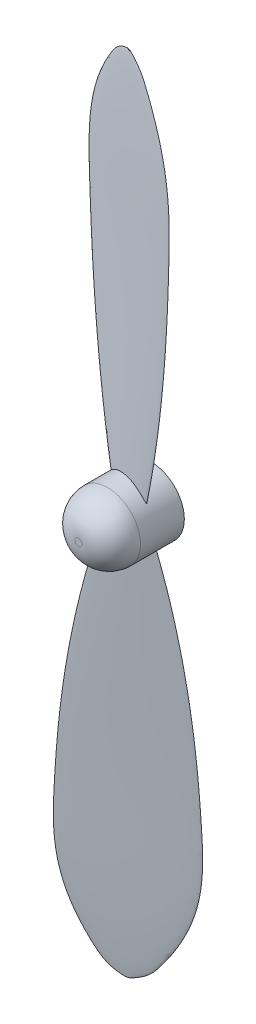
ISO-10303-21;
HEADER;
FILE_DESCRIPTION(('STEP AP214'),'2;1');
FILE_NAME('part.step','',(''),(''),'','','');
FILE_SCHEMA(('AUTOMOTIVE_DESIGN { 1 0 10303 214 1 1 1 1 }'));
ENDSEC;
DATA;
#1=APPLICATION_CONTEXT('core data for automotive mechanical design processes');
#2=APPLICATION_PROTOCOL_DEFINITION('international standard','automotive_design',2000,#1);
#3=PRODUCT_CONTEXT('',#1,'mechanical');
#4=PRODUCT('Part','Part','',(#3));
#5=PRODUCT_RELATED_PRODUCT_CATEGORY('part','',(#4));
#6=PRODUCT_DEFINITION_FORMATION('','',#4);
#7=PRODUCT_DEFINITION_CONTEXT('part definition',#1,'design');
#8=PRODUCT_DEFINITION('design','',#6,#7);
#9=PRODUCT_DEFINITION_SHAPE('','',#8);
#10=(LENGTH_UNIT() NAMED_UNIT(*) SI_UNIT(.MILLI.,.METRE.));
#11=(NAMED_UNIT(*) PLANE_ANGLE_UNIT() SI_UNIT($,.RADIAN.));
#12=(NAMED_UNIT(*) SI_UNIT($,.STERADIAN.) SOLID_ANGLE_UNIT());
#13=UNCERTAINTY_MEASURE_WITH_UNIT(LENGTH_MEASURE(1.E-05),#10,'distance_accuracy_value','');
#14=(GEOMETRIC_REPRESENTATION_CONTEXT(3) GLOBAL_UNCERTAINTY_ASSIGNED_CONTEXT((#13)) GLOBAL_UNIT_ASSIGNED_CONTEXT((#10,
#11,#12)) REPRESENTATION_CONTEXT('',''));
#15=CARTESIAN_POINT('',(0.,0.,0.));
#16=DIRECTION('',(0.,0.,1.));
#17=DIRECTION('',(1.,0.,0.));
#18=AXIS2_PLACEMENT_3D('',#15,#16,#17);
#19=CARTESIAN_POINT('',(0.,0.,5.));
#20=DIRECTION('',(0.,0.,-1.));
#21=DIRECTION('',(-1.,0.,0.));
#22=AXIS2_PLACEMENT_3D('',#19,#20,#21);
#23=CYLINDRICAL_SURFACE('',#22,2.25);
#24=CARTESIAN_POINT('',(-0.685189785943064,-2.14313204381795,1.63203231803167));
#25=CARTESIAN_POINT('',(-0.74644750585607,-2.12355081159836,1.64820016741624));
#26=CARTESIAN_POINT('',(-0.80683467098067,-2.10134669201663,1.66433866314273));
#27=CARTESIAN_POINT('',(-0.925466857541169,-2.0518606743238,1.69653461161696));
#28=CARTESIAN_POINT('',(-0.983713724184348,-2.02458327915829,1.71259212336271));
#29=CARTESIAN_POINT('',(-1.09765317993965,-1.96514250224772,1.74466640455545));
#30=CARTESIAN_POINT('',(-1.15334646002861,-1.93298045252455,1.76068318390297));
#31=CARTESIAN_POINT('',(-1.23462522480374,-1.88128485398878,1.78484131829155));
#32=CARTESIAN_POINT('',(-1.26134222882086,-1.86347684822216,1.79291649028685));
#33=CARTESIAN_POINT('',(-1.31397188812397,-1.82674769767045,1.80918197852093));
#34=CARTESIAN_POINT('',(-1.33988444401195,-1.80782641615813,1.81737230880851));
#35=CARTESIAN_POINT('',(-1.39074688230657,-1.76899515727584,1.83396548315611));
#36=CARTESIAN_POINT('',(-1.4156995724633,-1.74908852710075,1.84236756578208));
#37=CARTESIAN_POINT('',(-1.46463328559591,-1.70832128834852,1.85964489612402));
#38=CARTESIAN_POINT('',(-1.48861464590217,-1.68746101641033,1.86851997705055));
#39=CARTESIAN_POINT('',(-1.52371231857858,-1.65561178640228,1.88273949540181));
#40=CARTESIAN_POINT('',(-1.5352646701362,-1.64490337094234,1.88762993402965));
#41=CARTESIAN_POINT('',(-1.55232020773432,-1.62876132023649,1.89542288555363));
#42=CARTESIAN_POINT('',(-1.55796229503903,-1.6233650226325,1.89809802107974));
#43=CARTESIAN_POINT('',(-1.56913069115569,-1.61257216096081,1.90367795202165));
#44=CARTESIAN_POINT('',(-1.57465704090489,-1.60717559768797,1.90658266443766));
#45=CARTESIAN_POINT('',(-1.58390682944272,-1.59805129066569,1.91187174366217));
#46=CARTESIAN_POINT('',(-1.58767454678806,-1.59430778605514,1.91415141808976));
#47=CARTESIAN_POINT('',(-1.59507325595166,-1.58690525708869,1.91903474549877));
#48=CARTESIAN_POINT('',(-1.59870454664393,-1.58324605579052,1.92163762910493));
#49=CARTESIAN_POINT('',(-1.60347708962813,-1.57840575014235,1.92575593717719));
#50=CARTESIAN_POINT('',(-1.60476071760307,-1.57710053127219,1.92693911437819));
#51=CARTESIAN_POINT('',(-1.60723175026222,-1.57458225523671,1.92948420543351));
#52=CARTESIAN_POINT('',(-1.60841882164703,-1.57336951813591,1.93084669914535));
#53=CARTESIAN_POINT('',(-1.61062537808174,-1.57111047658597,1.93394027196211));
#54=CARTESIAN_POINT('',(-1.61164386353939,-1.5700651659595,1.93567341900376));
#55=CARTESIAN_POINT('',(-1.61244204813541,-1.56924529142736,1.93846106857146));
#56=CARTESIAN_POINT('',(-1.61259791536175,-1.56908507254034,1.93925421729678));
#57=CARTESIAN_POINT('',(-1.61269434145246,-1.56898596843197,1.94088326908224));
#58=CARTESIAN_POINT('',(-1.61263308372294,-1.56904895064032,1.94171947490971));
#59=CARTESIAN_POINT('',(-1.61231655188126,-1.56937419679628,1.94318258301086));
#60=CARTESIAN_POINT('',(-1.61208825688173,-1.56960874834834,1.94382252515371));
#61=CARTESIAN_POINT('',(-1.61134853568666,-1.57036820978598,1.94538781298661));
#62=CARTESIAN_POINT('',(-1.61074971374987,-1.57098255853553,1.94622199401988));
#63=CARTESIAN_POINT('',(-1.60927419402014,-1.57249419675917,1.9478892371452));
#64=CARTESIAN_POINT('',(-1.60836644126428,-1.57342275480882,1.9486582458682));
#65=CARTESIAN_POINT('',(-1.60648319362916,-1.57534554817697,1.95001921245802));
#66=CARTESIAN_POINT('',(-1.60550732283219,-1.57634014618768,1.95061007330458));
#67=CARTESIAN_POINT('',(-1.60262971456335,-1.57926729801073,1.95215882641957));
#68=CARTESIAN_POINT('',(-1.60068715589377,-1.58123633208802,1.95296677115143));
#69=CARTESIAN_POINT('',(-1.59675600123957,-1.58520603396645,1.95436993782799));
#70=CARTESIAN_POINT('',(-1.59476730044277,-1.58720676965893,1.95496461178475));
#71=CARTESIAN_POINT('',(-1.5887602408541,-1.59322721950857,1.95654411921855));
#72=CARTESIAN_POINT('',(-1.58470390306063,-1.59726214516245,1.95732321677621));
#73=CARTESIAN_POINT('',(-1.57254070411581,-1.609268412863,1.95923449061218));
#74=CARTESIAN_POINT('',(-1.56436113739136,-1.61722117952682,1.9599641075034));
#75=CARTESIAN_POINT('',(-1.5478638859351,-1.63301810469839,1.96091462467503));
#76=CARTESIAN_POINT('',(-1.53954608327985,-1.64086215877522,1.96113506551624));
#77=CARTESIAN_POINT('',(-1.52280085099785,-1.65641418002475,1.96123996485792));
#78=CARTESIAN_POINT('',(-1.51437356386912,-1.66412229827152,1.96112482354703));
#79=CARTESIAN_POINT('',(-1.4974110092652,-1.67940184326246,1.96064616887555));
#80=CARTESIAN_POINT('',(-1.48887579240205,-1.68697333030975,1.96028276798148));
#81=CARTESIAN_POINT('',(-1.46300388697649,-1.70957484092336,1.9588997803424));
#82=CARTESIAN_POINT('',(-1.44550160089993,-1.72439842410276,1.95758831024083));
#83=CARTESIAN_POINT('',(-1.4100807769207,-1.75348157434405,1.95442328846277));
#84=CARTESIAN_POINT('',(-1.39216215437897,-1.7677410250998,1.95256962565779));
#85=CARTESIAN_POINT('',(-1.3377844770921,-1.80967642836665,1.94637514811137));
#86=CARTESIAN_POINT('',(-1.30072630733146,-1.83648961883632,1.94140244620521));
#87=CARTESIAN_POINT('',(-1.22509460352205,-1.8877859801758,1.93025768349541));
#88=CARTESIAN_POINT('',(-1.18651795788827,-1.91226397270999,1.92408304545721));
#89=CARTESIAN_POINT('',(-1.10808208721789,-1.95875793799037,1.91078773025972));
#90=CARTESIAN_POINT('',(-1.06822315974213,-1.98077447669924,1.90366727140053));
#91=CARTESIAN_POINT('',(-0.971484562979101,-2.03044839363161,1.88569883339147));
#92=CARTESIAN_POINT('',(-0.914063163662819,-2.05692932630093,1.87448454418993));
#93=CARTESIAN_POINT('',(-0.797412324768378,-2.10490340189266,1.85086312497672));
#94=CARTESIAN_POINT('',(-0.738182258028506,-2.1263947919317,1.83845557791831));
#95=CARTESIAN_POINT('',(-0.558426558947134,-2.18321269888119,1.79981534217759));
#96=CARTESIAN_POINT('',(-0.435714782426967,-2.21094450745326,1.77214186929734));
#97=CARTESIAN_POINT('',(-0.187273630144206,-2.24572310303304,1.71432541933568));
#98=CARTESIAN_POINT('',(-0.0615307739727725,-2.25264757510258,1.68416890610392));
#99=CARTESIAN_POINT('',(0.189120599149132,-2.24554326620669,1.62264295924614));
#100=CARTESIAN_POINT('',(0.314028637388038,-2.23150335228535,1.59127288979046));
#101=CARTESIAN_POINT('',(0.564235404257836,-2.18196134877176,1.52710114959061));
#102=CARTESIAN_POINT('',(0.689384132141361,-2.14569964257524,1.4942888080901));
#103=CARTESIAN_POINT('',(0.870779592469711,-2.07568215777385,1.44512521523003));
#104=CARTESIAN_POINT('',(0.930161238145245,-2.04975617717637,1.42875490536441));
#105=CARTESIAN_POINT('',(1.04645989720888,-1.99288762284824,1.39595158069623));
#106=CARTESIAN_POINT('',(1.10337771633746,-1.96194670508913,1.37951858833504));
#107=CARTESIAN_POINT('',(1.18626656215714,-1.91214538274399,1.35470770295585));
#108=CARTESIAN_POINT('',(1.21336181070013,-1.89506667600081,1.34644908807423));
#109=CARTESIAN_POINT('',(1.26675726918639,-1.85979808190868,1.32976904687442));
#110=CARTESIAN_POINT('',(1.29305772683039,-1.84160854620721,1.32134767265095));
#111=CARTESIAN_POINT('',(1.34477826646757,-1.80418646640654,1.30420542996096));
#112=CARTESIAN_POINT('',(1.3701989433495,-1.78495465058145,1.2954847721369));
#113=CARTESIAN_POINT('',(1.41081668592569,-1.75285396093071,1.28072676223126));
#114=CARTESIAN_POINT('',(1.42631235740033,-1.74026733468695,1.27489221796157));
#115=CARTESIAN_POINT('',(1.4568614068294,-1.71477377190837,1.26276567182326));
#116=CARTESIAN_POINT('',(1.47191486313919,-1.70186689287537,1.25647375169115));
#117=CARTESIAN_POINT('',(1.49404349542887,-1.68238865475326,1.24622725794154));
#118=CARTESIAN_POINT('',(1.5013522469624,-1.67586901006518,1.24267262910312));
#119=CARTESIAN_POINT('',(1.51574625561177,-1.66286078320019,1.23511062669529));
#120=CARTESIAN_POINT('',(1.52283204348885,-1.65637216431966,1.23110445196222));
#121=CARTESIAN_POINT('',(1.53198218318926,-1.64788979866398,1.22494762475677));
#122=CARTESIAN_POINT('',(1.53426949557447,-1.64576021753518,1.22332107492842));
#123=CARTESIAN_POINT('',(1.53873949083752,-1.64158153111097,1.21984139612094));
#124=CARTESIAN_POINT('',(1.54092247980609,-1.63953219403941,1.21798899491572));
#125=CARTESIAN_POINT('',(1.54402770336853,-1.63660641811744,1.2148551186465));
#126=CARTESIAN_POINT('',(1.54504140796482,-1.63564936258635,1.21374170898181));
#127=CARTESIAN_POINT('',(1.54693963612947,-1.63385415086222,1.21133279501419));
#128=CARTESIAN_POINT('',(1.54782534989861,-1.63301490160032,1.21003922255005));
#129=CARTESIAN_POINT('',(1.54900184111987,-1.63189879999285,1.20767677506162));
#130=CARTESIAN_POINT('',(1.54939069486559,-1.63152952319296,1.20671028813066));
#131=CARTESIAN_POINT('',(1.54983149687274,-1.63111078923366,1.20490936389089));
#132=CARTESIAN_POINT('',(1.5499454780748,-1.63100245518137,1.20410798050603));
#133=CARTESIAN_POINT('',(1.54994879769731,-1.63099930433925,1.20249261010553));
#134=CARTESIAN_POINT('',(1.54983667436708,-1.63110587690625,1.20167857505624));
#135=CARTESIAN_POINT('',(1.54943433257526,-1.63148806492925,1.20024926156482));
#136=CARTESIAN_POINT('',(1.54916464248123,-1.63174419370914,1.19962201387163));
#137=CARTESIAN_POINT('',(1.54827460249867,-1.63258885122657,1.19800113435712));
#138=CARTESIAN_POINT('',(1.54754775096568,-1.63327801414738,1.19712664439317));
#139=CARTESIAN_POINT('',(1.54570572995305,-1.63502170949835,1.19531742063329));
#140=CARTESIAN_POINT('',(1.54454648760132,-1.6361169867198,1.19448050112667));
#141=CARTESIAN_POINT('',(1.54215298664701,-1.63837325701982,1.19301462189789));
#142=CARTESIAN_POINT('',(1.54091826965236,-1.63953464793723,1.19238712198457));
#143=CARTESIAN_POINT('',(1.5371149974331,-1.64310366960748,1.19067831727715));
#144=CARTESIAN_POINT('',(1.53449462922277,-1.64555131570823,1.18980369645752));
#145=CARTESIAN_POINT('',(1.52920132887709,-1.65047160250327,1.18831622294703));
#146=CARTESIAN_POINT('',(1.52652827808938,-1.65294429154276,1.1877040547139));
#147=CARTESIAN_POINT('',(1.51846387418725,-1.66036764818918,1.18611609383731));
#148=CARTESIAN_POINT('',(1.51302819977777,-1.66532273186647,1.18538914967671));
#149=CARTESIAN_POINT('',(1.49672809279306,-1.68003517351344,1.18370953966029));
#150=CARTESIAN_POINT('',(1.48577075149493,-1.68973345934125,1.18323539537559));
#151=CARTESIAN_POINT('',(1.46365350337622,-1.70892753666718,1.18289539521517));
#152=CARTESIAN_POINT('',(1.45249333622051,-1.71842302804046,1.18303038556301));
#153=CARTESIAN_POINT('',(1.4300105746586,-1.73717694941233,1.18371930320527));
#154=CARTESIAN_POINT('',(1.41868818338933,-1.74643564128716,1.18427274500979));
#155=CARTESIAN_POINT('',(1.39588363602214,-1.76471594663822,1.1856823489617));
#156=CARTESIAN_POINT('',(1.38440156910835,-1.77373768492128,1.18653834816746));
#157=CARTESIAN_POINT('',(1.35047790242443,-1.79986272096231,1.18939958704705));
#158=CARTESIAN_POINT('',(1.32781523439936,-1.81664512699036,1.19173153763623));
#159=CARTESIAN_POINT('',(1.28192441311979,-1.84931436165184,1.19703553668543));
#160=CARTESIAN_POINT('',(1.25869613786632,-1.86520099457649,1.20000772434616));
#161=CARTESIAN_POINT('',(1.18817404410803,-1.91151951466654,1.20968815955496));
#162=CARTESIAN_POINT('',(1.14007670600186,-1.9405840610698,1.21715694934756));
#163=CARTESIAN_POINT('',(1.04194145227939,-1.99499680711911,1.23356014930815));
#164=CARTESIAN_POINT('',(0.991899707222955,-2.02033714853379,1.24249757658265));
#165=CARTESIAN_POINT('',(0.890277820713408,-2.06713245401985,1.26151633879384));
#166=CARTESIAN_POINT('',(0.838698253298583,-2.08858884725598,1.27159725073574));
#167=CARTESIAN_POINT('',(0.68252660347505,-2.14684504080969,1.30312285839768));
#168=CARTESIAN_POINT('',(0.575972793889898,-2.17782334941073,1.32594308114425));
#169=CARTESIAN_POINT('',(0.360077794134436,-2.22374560900688,1.37397846546132));
#170=CARTESIAN_POINT('',(0.250736667887246,-2.23868992738054,1.39919357214466));
#171=CARTESIAN_POINT('',(0.0013827896828368,-2.2543408593677,1.45820613233889));
#172=CARTESIAN_POINT('',(-0.138857994773048,-2.25004969939111,1.49246798198546));
#173=CARTESIAN_POINT('',(-0.415821063729058,-2.21563403133452,1.5618770671148));
#174=CARTESIAN_POINT('',(-0.552546299409378,-2.18553197179308,1.59702350746598));
#175=CARTESIAN_POINT('',(-0.685189785943064,-2.14313204381795,1.63203231803167));
#176=B_SPLINE_CURVE_WITH_KNOTS('',3,(#24,#25,#26,#27,#28,#29,#30,#31,#32,#33,#34,#35,#36,#37,
#38,#39,#40,#41,#42,#43,#44,#45,#46,#47,#48,#49,#50,#51,#52,#53,#54,#55,#56,#57,#58,#59,#60,#61,
#62,#63,#64,#65,#66,#67,#68,#69,#70,#71,#72,#73,#74,#75,#76,#77,#78,#79,#80,#81,#82,#83,#84,#85,
#86,#87,#88,#89,#90,#91,#92,#93,#94,#95,#96,#97,#98,#99,#100,#101,#102,#103,#104,#105,#106,#107,
#108,#109,#110,#111,#112,#113,#114,#115,#116,#117,#118,#119,#120,#121,#122,#123,#124,#125,#126,
#127,#128,#129,#130,#131,#132,#133,#134,#135,#136,#137,#138,#139,#140,#141,#142,#143,#144,#145,
#146,#147,#148,#149,#150,#151,#152,#153,#154,#155,#156,#157,#158,#159,#160,#161,#162,#163,#164,
#165,#166,#167,#168,#169,#170,#171,#172,#173,#174,#175),.UNSPECIFIED.,.T.,.F.,(4,2,2,2,2,2,2,2,
2,2,2,2,2,2,2,2,2,2,2,2,2,2,2,2,2,2,2,2,2,2,2,2,2,2,2,2,2,2,2,2,2,2,2,2,2,2,2,2,2,2,2,2,2,2,2,2,
2,2,2,2,2,2,2,2,2,2,2,2,2,2,2,2,2,2,2,4),(0.,0.198815258945486,0.397454888064141,
0.596040446045284,0.695340534392482,0.79465284386435,0.893648283491804,0.992609043220647,
1.04207923484797,1.06683598253726,1.09158382041326,1.10892003677252,1.12621574944079,
1.13274040877817,1.13928671063713,1.14587053536251,1.14830211936333,1.15075409525926,
1.15287889351258,1.15640898750257,1.16091491553209,1.16544804917242,1.17407190519084,
1.1827177636222,1.20002267985698,1.23429129579204,1.2685908208896,1.30284945983767,
1.33709258922471,1.40599057659788,1.47490269529428,1.61281722771179,1.75103080535386,
1.88921253787103,2.08161504468135,2.27408504275405,2.65861794048699,3.04540691727295,
3.43240136806236,3.83342554245418,4.03373179748404,4.23397204406896,4.33317825413118,
4.43235322034329,4.53145976156106,4.59385032703214,4.6562297701187,4.68748841897411,
4.7186659498582,4.7292331304861,4.73976711774973,4.74511366219737,4.7504067529359,
4.75368163592826,4.75608716471827,4.7585082949447,4.76066810722098,4.76459181934585,
4.76996988866953,4.77538470006466,4.78643051553101,4.79750496501233,4.81965778293197,
4.86354937534927,4.90750196171415,4.95140363212471,4.99528169532148,5.08013636976356,
5.16500951201236,5.33488352045456,5.50511097685595,5.67527566727337,6.01379082222227,
6.35229822078221,6.7831742311905,7.21367587506621),.UNSPECIFIED.);
#177=CARTESIAN_POINT('',(-0.685189785943064,-2.14313204381795,1.63203231803167));
#178=VERTEX_POINT('',#177);
#179=EDGE_CURVE('E115',#178,#178,#176,.T.);
#180=ORIENTED_EDGE('',*,*,#179,.T.);
#181=EDGE_LOOP('',(#180));
#182=FACE_BOUND('',#181,.T.);
#183=CARTESIAN_POINT('',(0.685189785943064,2.14313204381795,1.63203231803167));
#184=CARTESIAN_POINT('',(0.74644750585607,2.12355081159836,1.64820016741624));
#185=CARTESIAN_POINT('',(0.80683467098067,2.10134669201663,1.66433866314273));
#186=CARTESIAN_POINT('',(0.925466857541169,2.0518606743238,1.69653461161696));
#187=CARTESIAN_POINT('',(0.983713724184348,2.02458327915829,1.71259212336271));
#188=CARTESIAN_POINT('',(1.09765317993965,1.96514250224772,1.74466640455545));
#189=CARTESIAN_POINT('',(1.15334646002861,1.93298045252455,1.76068318390297));
#190=CARTESIAN_POINT('',(1.23462522480374,1.88128485398878,1.78484131829155));
#191=CARTESIAN_POINT('',(1.26134222882086,1.86347684822216,1.79291649028685));
#192=CARTESIAN_POINT('',(1.31397188812397,1.82674769767045,1.80918197852093));
#193=CARTESIAN_POINT('',(1.33988444401195,1.80782641615813,1.81737230880851));
#194=CARTESIAN_POINT('',(1.39074688230657,1.76899515727584,1.83396548315611));
#195=CARTESIAN_POINT('',(1.4156995724633,1.74908852710075,1.84236756578208));
#196=CARTESIAN_POINT('',(1.46463328559591,1.70832128834852,1.85964489612402));
#197=CARTESIAN_POINT('',(1.48861464590217,1.68746101641033,1.86851997705055));
#198=CARTESIAN_POINT('',(1.52371231857858,1.65561178640228,1.88273949540181));
#199=CARTESIAN_POINT('',(1.5352646701362,1.64490337094234,1.88762993402965));
#200=CARTESIAN_POINT('',(1.55232020773432,1.62876132023649,1.89542288555363));
#201=CARTESIAN_POINT('',(1.55796229503903,1.6233650226325,1.89809802107974));
#202=CARTESIAN_POINT('',(1.56913069115569,1.61257216096081,1.90367795202165));
#203=CARTESIAN_POINT('',(1.57465704090489,1.60717559768797,1.90658266443766));
#204=CARTESIAN_POINT('',(1.58390682944272,1.59805129066569,1.91187174366217));
#205=CARTESIAN_POINT('',(1.58767454678806,1.59430778605514,1.91415141808976));
#206=CARTESIAN_POINT('',(1.59507325595166,1.58690525708869,1.91903474549877));
#207=CARTESIAN_POINT('',(1.59870454664393,1.58324605579052,1.92163762910493));
#208=CARTESIAN_POINT('',(1.60347708962813,1.57840575014235,1.92575593717719));
#209=CARTESIAN_POINT('',(1.60476071760307,1.57710053127219,1.92693911437819));
#210=CARTESIAN_POINT('',(1.60723175026222,1.57458225523671,1.92948420543351));
#211=CARTESIAN_POINT('',(1.60841882164703,1.57336951813591,1.93084669914535));
#212=CARTESIAN_POINT('',(1.61062537808174,1.57111047658597,1.93394027196211));
#213=CARTESIAN_POINT('',(1.61164386353939,1.5700651659595,1.93567341900376));
#214=CARTESIAN_POINT('',(1.61244204813541,1.56924529142736,1.93846106857146));
#215=CARTESIAN_POINT('',(1.61259791536175,1.56908507254034,1.93925421729678));
#216=CARTESIAN_POINT('',(1.61269434145246,1.56898596843197,1.94088326908224));
#217=CARTESIAN_POINT('',(1.61263308372294,1.56904895064032,1.94171947490971));
#218=CARTESIAN_POINT('',(1.61231655188126,1.56937419679628,1.94318258301086));
#219=CARTESIAN_POINT('',(1.61208825688173,1.56960874834834,1.94382252515371));
#220=CARTESIAN_POINT('',(1.61134853568666,1.57036820978598,1.94538781298661));
#221=CARTESIAN_POINT('',(1.61074971374987,1.57098255853553,1.94622199401988));
#222=CARTESIAN_POINT('',(1.60927419402014,1.57249419675917,1.9478892371452));
#223=CARTESIAN_POINT('',(1.60836644126428,1.57342275480882,1.9486582458682));
#224=CARTESIAN_POINT('',(1.60648319362916,1.57534554817697,1.95001921245802));
#225=CARTESIAN_POINT('',(1.60550732283219,1.57634014618768,1.95061007330458));
#226=CARTESIAN_POINT('',(1.60262971456335,1.57926729801073,1.95215882641957));
#227=CARTESIAN_POINT('',(1.60068715589377,1.58123633208802,1.95296677115143));
#228=CARTESIAN_POINT('',(1.59675600123957,1.58520603396645,1.95436993782799));
#229=CARTESIAN_POINT('',(1.59476730044277,1.58720676965893,1.95496461178475));
#230=CARTESIAN_POINT('',(1.5887602408541,1.59322721950857,1.95654411921855));
#231=CARTESIAN_POINT('',(1.58470390306063,1.59726214516245,1.95732321677621));
#232=CARTESIAN_POINT('',(1.57254070411581,1.609268412863,1.95923449061218));
#233=CARTESIAN_POINT('',(1.56436113739136,1.61722117952682,1.9599641075034));
#234=CARTESIAN_POINT('',(1.5478638859351,1.63301810469839,1.96091462467503));
#235=CARTESIAN_POINT('',(1.53954608327985,1.64086215877522,1.96113506551624));
#236=CARTESIAN_POINT('',(1.52280085099785,1.65641418002475,1.96123996485792));
#237=CARTESIAN_POINT('',(1.51437356386912,1.66412229827152,1.96112482354703));
#238=CARTESIAN_POINT('',(1.4974110092652,1.67940184326246,1.96064616887555));
#239=CARTESIAN_POINT('',(1.48887579240205,1.68697333030975,1.96028276798148));
#240=CARTESIAN_POINT('',(1.46300388697649,1.70957484092336,1.9588997803424));
#241=CARTESIAN_POINT('',(1.44550160089993,1.72439842410276,1.95758831024083));
#242=CARTESIAN_POINT('',(1.4100807769207,1.75348157434405,1.95442328846277));
#243=CARTESIAN_POINT('',(1.39216215437897,1.7677410250998,1.95256962565779));
#244=CARTESIAN_POINT('',(1.3377844770921,1.80967642836665,1.94637514811137));
#245=CARTESIAN_POINT('',(1.30072630733146,1.83648961883632,1.94140244620521));
#246=CARTESIAN_POINT('',(1.22509460352205,1.8877859801758,1.93025768349541));
#247=CARTESIAN_POINT('',(1.18651795788827,1.91226397270999,1.92408304545721));
#248=CARTESIAN_POINT('',(1.10808208721789,1.95875793799037,1.91078773025972));
#249=CARTESIAN_POINT('',(1.06822315974213,1.98077447669924,1.90366727140053));
#250=CARTESIAN_POINT('',(0.971484562979101,2.03044839363161,1.88569883339147));
#251=CARTESIAN_POINT('',(0.914063163662819,2.05692932630093,1.87448454418993));
#252=CARTESIAN_POINT('',(0.797412324768378,2.10490340189266,1.85086312497672));
#253=CARTESIAN_POINT('',(0.738182258028506,2.1263947919317,1.83845557791831));
#254=CARTESIAN_POINT('',(0.558426558947134,2.18321269888119,1.79981534217759));
#255=CARTESIAN_POINT('',(0.435714782426967,2.21094450745326,1.77214186929734));
#256=CARTESIAN_POINT('',(0.187273630144206,2.24572310303304,1.71432541933568));
#257=CARTESIAN_POINT('',(0.0615307739727725,2.25264757510258,1.68416890610392));
#258=CARTESIAN_POINT('',(-0.189120599149132,2.24554326620669,1.62264295924614));
#259=CARTESIAN_POINT('',(-0.314028637388038,2.23150335228535,1.59127288979046));
#260=CARTESIAN_POINT('',(-0.564235404257836,2.18196134877176,1.52710114959061));
#261=CARTESIAN_POINT('',(-0.689384132141361,2.14569964257524,1.4942888080901));
#262=CARTESIAN_POINT('',(-0.870779592469711,2.07568215777385,1.44512521523003));
#263=CARTESIAN_POINT('',(-0.930161238145245,2.04975617717637,1.42875490536441));
#264=CARTESIAN_POINT('',(-1.04645989720888,1.99288762284824,1.39595158069623));
#265=CARTESIAN_POINT('',(-1.10337771633746,1.96194670508913,1.37951858833504));
#266=CARTESIAN_POINT('',(-1.18626656215714,1.91214538274399,1.35470770295585));
#267=CARTESIAN_POINT('',(-1.21336181070013,1.89506667600081,1.34644908807423));
#268=CARTESIAN_POINT('',(-1.26675726918639,1.85979808190868,1.32976904687442));
#269=CARTESIAN_POINT('',(-1.29305772683039,1.84160854620721,1.32134767265095));
#270=CARTESIAN_POINT('',(-1.34477826646757,1.80418646640654,1.30420542996096));
#271=CARTESIAN_POINT('',(-1.3701989433495,1.78495465058145,1.2954847721369));
#272=CARTESIAN_POINT('',(-1.41081668592569,1.75285396093071,1.28072676223126));
#273=CARTESIAN_POINT('',(-1.42631235740033,1.74026733468695,1.27489221796157));
#274=CARTESIAN_POINT('',(-1.4568614068294,1.71477377190837,1.26276567182326));
#275=CARTESIAN_POINT('',(-1.47191486313919,1.70186689287537,1.25647375169115));
#276=CARTESIAN_POINT('',(-1.49404349542887,1.68238865475326,1.24622725794154));
#277=CARTESIAN_POINT('',(-1.5013522469624,1.67586901006518,1.24267262910312));
#278=CARTESIAN_POINT('',(-1.51574625561177,1.66286078320019,1.23511062669529));
#279=CARTESIAN_POINT('',(-1.52283204348885,1.65637216431966,1.23110445196222));
#280=CARTESIAN_POINT('',(-1.53198218318926,1.64788979866398,1.22494762475677));
#281=CARTESIAN_POINT('',(-1.53426949557447,1.64576021753518,1.22332107492842));
#282=CARTESIAN_POINT('',(-1.53873949083752,1.64158153111097,1.21984139612094));
#283=CARTESIAN_POINT('',(-1.54092247980609,1.63953219403941,1.21798899491572));
#284=CARTESIAN_POINT('',(-1.54402770336853,1.63660641811744,1.2148551186465));
#285=CARTESIAN_POINT('',(-1.54504140796482,1.63564936258635,1.21374170898181));
#286=CARTESIAN_POINT('',(-1.54693963612947,1.63385415086222,1.21133279501419));
#287=CARTESIAN_POINT('',(-1.54782534989861,1.63301490160032,1.21003922255005));
#288=CARTESIAN_POINT('',(-1.54900184111987,1.63189879999285,1.20767677506162));
#289=CARTESIAN_POINT('',(-1.54939069486559,1.63152952319296,1.20671028813066));
#290=CARTESIAN_POINT('',(-1.54983149687274,1.63111078923366,1.20490936389089));
#291=CARTESIAN_POINT('',(-1.5499454780748,1.63100245518137,1.20410798050603));
#292=CARTESIAN_POINT('',(-1.54994879769731,1.63099930433925,1.20249261010553));
#293=CARTESIAN_POINT('',(-1.54983667436708,1.63110587690625,1.20167857505624));
#294=CARTESIAN_POINT('',(-1.54943433257526,1.63148806492925,1.20024926156482));
#295=CARTESIAN_POINT('',(-1.54916464248123,1.63174419370914,1.19962201387163));
#296=CARTESIAN_POINT('',(-1.54827460249867,1.63258885122657,1.19800113435712));
#297=CARTESIAN_POINT('',(-1.54754775096568,1.63327801414738,1.19712664439317));
#298=CARTESIAN_POINT('',(-1.54570572995305,1.63502170949835,1.19531742063329));
#299=CARTESIAN_POINT('',(-1.54454648760132,1.6361169867198,1.19448050112667));
#300=CARTESIAN_POINT('',(-1.54215298664701,1.63837325701982,1.19301462189789));
#301=CARTESIAN_POINT('',(-1.54091826965236,1.63953464793723,1.19238712198457));
#302=CARTESIAN_POINT('',(-1.5371149974331,1.64310366960748,1.19067831727715));
#303=CARTESIAN_POINT('',(-1.53449462922277,1.64555131570823,1.18980369645752));
#304=CARTESIAN_POINT('',(-1.52920132887709,1.65047160250327,1.18831622294703));
#305=CARTESIAN_POINT('',(-1.52652827808938,1.65294429154276,1.1877040547139));
#306=CARTESIAN_POINT('',(-1.51846387418725,1.66036764818918,1.18611609383731));
#307=CARTESIAN_POINT('',(-1.51302819977777,1.66532273186647,1.18538914967671));
#308=CARTESIAN_POINT('',(-1.49672809279306,1.68003517351344,1.18370953966029));
#309=CARTESIAN_POINT('',(-1.48577075149493,1.68973345934125,1.18323539537559));
#310=CARTESIAN_POINT('',(-1.46365350337622,1.70892753666718,1.18289539521517));
#311=CARTESIAN_POINT('',(-1.45249333622051,1.71842302804046,1.18303038556301));
#312=CARTESIAN_POINT('',(-1.4300105746586,1.73717694941233,1.18371930320527));
#313=CARTESIAN_POINT('',(-1.41868818338933,1.74643564128716,1.18427274500979));
#314=CARTESIAN_POINT('',(-1.39588363602214,1.76471594663822,1.1856823489617));
#315=CARTESIAN_POINT('',(-1.38440156910835,1.77373768492128,1.18653834816746));
#316=CARTESIAN_POINT('',(-1.35047790242443,1.79986272096231,1.18939958704705));
#317=CARTESIAN_POINT('',(-1.32781523439936,1.81664512699036,1.19173153763623));
#318=CARTESIAN_POINT('',(-1.28192441311979,1.84931436165184,1.19703553668543));
#319=CARTESIAN_POINT('',(-1.25869613786632,1.86520099457649,1.20000772434616));
#320=CARTESIAN_POINT('',(-1.18817404410803,1.91151951466654,1.20968815955496));
#321=CARTESIAN_POINT('',(-1.14007670600186,1.9405840610698,1.21715694934756));
#322=CARTESIAN_POINT('',(-1.04194145227939,1.99499680711911,1.23356014930815));
#323=CARTESIAN_POINT('',(-0.991899707222955,2.02033714853379,1.24249757658265));
#324=CARTESIAN_POINT('',(-0.890277820713408,2.06713245401985,1.26151633879384));
#325=CARTESIAN_POINT('',(-0.838698253298583,2.08858884725598,1.27159725073574));
#326=CARTESIAN_POINT('',(-0.68252660347505,2.14684504080969,1.30312285839768));
#327=CARTESIAN_POINT('',(-0.575972793889898,2.17782334941073,1.32594308114425));
#328=CARTESIAN_POINT('',(-0.360077794134436,2.22374560900688,1.37397846546132));
#329=CARTESIAN_POINT('',(-0.250736667887246,2.23868992738054,1.39919357214466));
#330=CARTESIAN_POINT('',(-0.0013827896828368,2.2543408593677,1.45820613233889));
#331=CARTESIAN_POINT('',(0.138857994773048,2.25004969939111,1.49246798198546));
#332=CARTESIAN_POINT('',(0.415821063729058,2.21563403133452,1.5618770671148));
#333=CARTESIAN_POINT('',(0.552546299409378,2.18553197179308,1.59702350746598));
#334=CARTESIAN_POINT('',(0.685189785943064,2.14313204381795,1.63203231803167));
#335=B_SPLINE_CURVE_WITH_KNOTS('',3,(#183,#184,#185,#186,#187,#188,#189,#190,#191,#192,#193,
#194,#195,#196,#197,#198,#199,#200,#201,#202,#203,#204,#205,#206,#207,#208,#209,#210,#211,#212,
#213,#214,#215,#216,#217,#218,#219,#220,#221,#222,#223,#224,#225,#226,#227,#228,#229,#230,#231,
#232,#233,#234,#235,#236,#237,#238,#239,#240,#241,#242,#243,#244,#245,#246,#247,#248,#249,#250,
#251,#252,#253,#254,#255,#256,#257,#258,#259,#260,#261,#262,#263,#264,#265,#266,#267,#268,#269,
#270,#271,#272,#273,#274,#275,#276,#277,#278,#279,#280,#281,#282,#283,#284,#285,#286,#287,#288,
#289,#290,#291,#292,#293,#294,#295,#296,#297,#298,#299,#300,#301,#302,#303,#304,#305,#306,#307,
#308,#309,#310,#311,#312,#313,#314,#315,#316,#317,#318,#319,#320,#321,#322,#323,#324,#325,#326,
#327,#328,#329,#330,#331,#332,#333,#334),.UNSPECIFIED.,.T.,.F.,(4,2,2,2,2,2,2,2,2,2,2,2,2,2,2,2,
2,2,2,2,2,2,2,2,2,2,2,2,2,2,2,2,2,2,2,2,2,2,2,2,2,2,2,2,2,2,2,2,2,2,2,2,2,2,2,2,2,2,2,2,2,2,2,2,
2,2,2,2,2,2,2,2,2,2,2,4),(0.,0.198815258945486,0.397454888064141,0.596040446045284,
0.695340534392482,0.79465284386435,0.893648283491804,0.992609043220647,1.04207923484797,
1.06683598253726,1.09158382041326,1.10892003677252,1.12621574944079,1.13274040877817,
1.13928671063713,1.14587053536251,1.14830211936333,1.15075409525926,1.15287889351258,
1.15640898750257,1.16091491553209,1.16544804917242,1.17407190519084,1.1827177636222,
1.20002267985698,1.23429129579204,1.2685908208896,1.30284945983767,1.33709258922471,
1.40599057659788,1.47490269529428,1.61281722771179,1.75103080535386,1.88921253787103,
2.08161504468135,2.27408504275405,2.65861794048699,3.04540691727295,3.43240136806236,
3.83342554245418,4.03373179748404,4.23397204406896,4.33317825413118,4.43235322034329,
4.53145976156106,4.59385032703214,4.6562297701187,4.68748841897411,4.7186659498582,
4.7292331304861,4.73976711774973,4.74511366219737,4.7504067529359,4.75368163592826,
4.75608716471827,4.7585082949447,4.76066810722098,4.76459181934585,4.76996988866953,
4.77538470006466,4.78643051553101,4.79750496501233,4.81965778293197,4.86354937534927,
4.90750196171415,4.95140363212471,4.99528169532148,5.08013636976356,5.16500951201236,
5.33488352045456,5.50511097685595,5.67527566727337,6.01379082222227,6.35229822078221,
6.7831742311905,7.21367587506621),.UNSPECIFIED.);
#336=CARTESIAN_POINT('',(0.685189785943064,2.14313204381795,1.63203231803167));
#337=VERTEX_POINT('',#336);
#338=EDGE_CURVE('E130',#337,#337,#335,.T.);
#339=ORIENTED_EDGE('',*,*,#338,.T.);
#340=EDGE_LOOP('',(#339));
#341=FACE_BOUND('',#340,.T.);
#342=CARTESIAN_POINT('',(0.,0.,3.));
#343=DIRECTION('',(0.,0.,1.));
#344=DIRECTION('',(1.,0.,0.));
#345=AXIS2_PLACEMENT_3D('',#342,#343,#344);
#346=CIRCLE('',#345,2.25);
#347=CARTESIAN_POINT('',(2.25,0.,3.));
#348=VERTEX_POINT('',#347);
#349=EDGE_CURVE('E11',#348,#348,#346,.F.);
#350=ORIENTED_EDGE('',*,*,#349,.T.);
#351=EDGE_LOOP('',(#350));
#352=FACE_BOUND('',#351,.T.);
#353=CARTESIAN_POINT('',(0.,0.,0.));
#354=DIRECTION('',(0.,0.,1.));
#355=DIRECTION('',(1.,0.,0.));
#356=AXIS2_PLACEMENT_3D('',#353,#354,#355);
#357=CIRCLE('',#356,2.25);
#358=CARTESIAN_POINT('',(2.25,0.,0.));
#359=VERTEX_POINT('',#358);
#360=EDGE_CURVE('E127',#359,#359,#357,.T.);
#361=ORIENTED_EDGE('',*,*,#360,.T.);
#362=EDGE_LOOP('',(#361));
#363=FACE_BOUND('',#362,.T.);
#364=ADVANCED_FACE('F111',(#182,#341,#352,#363),#23,.T.);
#365=CARTESIAN_POINT('',(0.,0.,5.));
#366=DIRECTION('',(0.,0.,1.));
#367=DIRECTION('',(1.,0.,0.));
#368=AXIS2_PLACEMENT_3D('',#365,#366,#367);
#369=PLANE('',#368);
#370=CARTESIAN_POINT('',(0.,0.,5.));
#371=DIRECTION('',(0.,0.,1.));
#372=DIRECTION('',(1.,0.,0.));
#373=AXIS2_PLACEMENT_3D('',#370,#371,#372);
#374=CIRCLE('',#373,0.25);
#375=CARTESIAN_POINT('',(0.25,0.,5.));
#376=VERTEX_POINT('',#375);
#377=EDGE_CURVE('E122',#376,#376,#374,.T.);
#378=ORIENTED_EDGE('',*,*,#377,.T.);
#379=EDGE_LOOP('',(#378));
#380=FACE_BOUND('',#379,.T.);
#381=ADVANCED_FACE('F188',(#380),#369,.T.);
#382=CARTESIAN_POINT('',(0.,0.,0.));
#383=DIRECTION('',(0.,0.,1.));
#384=DIRECTION('',(1.,0.,0.));
#385=AXIS2_PLACEMENT_3D('',#382,#383,#384);
#386=PLANE('',#385);
#387=ORIENTED_EDGE('',*,*,#360,.F.);
#388=EDGE_LOOP('',(#387));
#389=FACE_BOUND('',#388,.T.);
#390=ADVANCED_FACE('F186',(#389),#386,.F.);
#391=CARTESIAN_POINT('',(0.,0.,3.));
#392=DIRECTION('',(0.,0.,1.));
#393=DIRECTION('',(1.,0.,0.));
#394=AXIS2_PLACEMENT_3D('',#391,#392,#393);
#395=DEGENERATE_TOROIDAL_SURFACE('',#394,0.25,2.,.T.);
#396=ORIENTED_EDGE('',*,*,#349,.F.);
#397=EDGE_LOOP('',(#396));
#398=FACE_BOUND('',#397,.T.);
#399=ORIENTED_EDGE('',*,*,#377,.F.);
#400=EDGE_LOOP('',(#399));
#401=FACE_BOUND('',#400,.T.);
#402=ADVANCED_FACE('F113',(#398,#401),#395,.T.);
#403=CARTESIAN_POINT('',(0.543018535597763,1.,1.58741284244407));
#404=CARTESIAN_POINT('',(1.21517697652649,6.42247629226997,1.79617371965122));
#405=CARTESIAN_POINT('',(2.3650814661583,14.9119452171131,2.20498960431843));
#406=CARTESIAN_POINT('',(0.359811347249581,23.6541730381548,1.52008564009588));
#407=CARTESIAN_POINT('',(0.0972173686190061,27.0781330367908,1.53482179546618));
#408=CARTESIAN_POINT('',(0.113633534101407,27.5,1.57135943033859));
#409=CARTESIAN_POINT('',(0.506652139157457,1.,1.57831199530104));
#410=CARTESIAN_POINT('',(1.13925645253508,6.42237696222547,1.7737881770912));
#411=CARTESIAN_POINT('',(2.26879517296958,14.9088878719086,2.17442221719793));
#412=CARTESIAN_POINT('',(0.248442601020063,23.6579415701188,1.48579258409074));
#413=CARTESIAN_POINT('',(0.0684666505390642,27.0770744816428,1.52569517606046));
#414=CARTESIAN_POINT('',(0.109910675600326,27.5,1.56986061361376));
#415=CARTESIAN_POINT('',(0.433471904428403,1.,1.56025423923245));
#416=CARTESIAN_POINT('',(0.985472398005063,6.42209463758986,1.72867951101346));
#417=CARTESIAN_POINT('',(2.07125774160105,14.9047025115308,2.11194125367154));
#418=CARTESIAN_POINT('',(0.0292789466790903,23.6631484550289,1.41862867174485));
#419=CARTESIAN_POINT('',(0.0107681201492121,27.075611616503,1.50751280877574));
#420=CARTESIAN_POINT('',(0.10237091194904,27.5,1.56688164373397));
#421=CARTESIAN_POINT('',(0.322829884828847,1.,1.53368771209661));
#422=CARTESIAN_POINT('',(0.75285140764114,6.42144801061067,1.66123608392194));
#423=CARTESIAN_POINT('',(1.76648935087361,14.9044331995268,2.01611539889804));
#424=CARTESIAN_POINT('',(-0.294590895345148,23.6636893841086,1.32033079720421));
#425=CARTESIAN_POINT('',(-0.0741248793887288,27.075458424968,1.48112642720073));
#426=CARTESIAN_POINT('',(0.0908328676511551,27.5,1.56248430147078));
#427=CARTESIAN_POINT('',(0.211786855762667,1.,1.50772958424243));
#428=CARTESIAN_POINT('',(0.518458615408573,6.42060392068208,1.59399921330602));
#429=CARTESIAN_POINT('',(1.45420063919433,14.9099590628945,1.91847775391272));
#430=CARTESIAN_POINT('',(-0.611506156436974,23.6572134590816,1.22507620154521));
#431=CARTESIAN_POINT('',(-0.157349944195225,27.0772754654775,1.455621391861));
#432=CARTESIAN_POINT('',(0.0791201656587291,27.5,1.55817319361093));
#433=CARTESIAN_POINT('',(-0.454053427198067,1.,1.35616096669507));
#434=CARTESIAN_POINT('',(-0.889442777099674,6.41443486170904,1.19441983021372));
#435=CARTESIAN_POINT('',(-0.453382261196531,14.9761550165501,1.32508900057251));
#436=CARTESIAN_POINT('',(-2.46830017830974,23.5783448440877,0.67260516316747));
#437=CARTESIAN_POINT('',(-0.64392900814984,27.0994128459751,1.30862890110803));
#438=CARTESIAN_POINT('',(0.00811845429541204,27.5,1.53291468395311));
#439=CARTESIAN_POINT('',(-1.05687781484606,1.,1.25082288627525));
#440=CARTESIAN_POINT('',(-2.23834009429465,6.40351777421211,0.842647797179102));
#441=CARTESIAN_POINT('',(-2.35587282083641,15.283771148593,0.757757921882854));
#442=CARTESIAN_POINT('',(-3.91136516771118,23.206022934042,0.285465566768474));
#443=CARTESIAN_POINT('',(-0.958675308841999,27.2039546334853,1.2311865795521));
#444=CARTESIAN_POINT('',(-0.0621743346568795,27.5,1.51466978650742));
#445=CARTESIAN_POINT('',(-1.55864692313568,1.,1.2387294607884));
#446=CARTESIAN_POINT('',(-3.31311796897248,6.40507001732478,0.646641100825791));
#447=CARTESIAN_POINT('',(-4.56536489994148,15.3243488749774,0.128945245098773));
#448=CARTESIAN_POINT('',(-4.36505719283884,23.1559295568873,0.311398071221897));
#449=CARTESIAN_POINT('',(-0.973519468071149,27.2180259821542,1.2762402141056));
#450=CARTESIAN_POINT('',(-0.134932124670232,27.5,1.51044258719185));
#451=CARTESIAN_POINT('',(-1.1944671555613,1.,1.3810495071348));
#452=CARTESIAN_POINT('',(-2.56803308652015,6.42306486165229,0.921472430081473));
#453=CARTESIAN_POINT('',(-3.99952494778586,14.9226943681889,0.34922473080538));
#454=CARTESIAN_POINT('',(-2.75912955827603,23.6408450560995,0.870766104345873));
#455=CARTESIAN_POINT('',(-0.514003913309073,27.0818772451812,1.44732663495404));
#456=CARTESIAN_POINT('',(-0.10729906682939,27.5,1.5328729302477));
#457=CARTESIAN_POINT('',(0.260188702050953,1.,1.74508339285623));
#458=CARTESIAN_POINT('',(0.308601377485714,6.42204398797304,1.76301730174132));
#459=CARTESIAN_POINT('',(-0.539152911922517,14.8998308635803,1.45252645887213));
#460=CARTESIAN_POINT('',(2.22598649375854,23.6691180667773,2.40603444527374));
#461=CARTESIAN_POINT('',(0.486759935650359,27.0739350035297,1.76635458027421));
#462=CARTESIAN_POINT('',(0.0416152732138649,27.5,1.59282559924091));
#463=CARTESIAN_POINT('',(1.07700500054535,1.,1.89831269222135));
#464=CARTESIAN_POINT('',(2.16649116749577,6.40302826996629,2.26124630413559));
#465=CARTESIAN_POINT('',(2.09810585997627,15.2786218657601,2.2454093980043));
#466=CARTESIAN_POINT('',(4.09859343550876,23.2124755782429,2.92019447025405));
#467=CARTESIAN_POINT('',(0.999993447491588,27.2021414988513,1.9030173993303));
#468=CARTESIAN_POINT('',(0.134881773060152,27.5,1.61906921976263));
#469=CARTESIAN_POINT('',(1.57877410883498,1.,1.91040611770821));
#470=CARTESIAN_POINT('',(3.30944969892702,6.40472933740385,2.48019894156979));
#471=CARTESIAN_POINT('',(4.49953518058638,15.3257228921298,2.93304282036969));
#472=CARTESIAN_POINT('',(4.29540724864121,23.1543621539564,2.81486747406911));
#473=CARTESIAN_POINT('',(1.08711417473669,27.2184655010353,1.88030630232294));
#474=CARTESIAN_POINT('',(0.207639563073504,27.5,1.6232964190782));
#475=CARTESIAN_POINT('',(1.3785211715562,1.,1.81477064304419));
#476=CARTESIAN_POINT('',(2.94627779708797,6.41910593297037,2.32579399900121));
#477=CARTESIAN_POINT('',(4.38706526314854,15.1081808830618,2.86142108391309));
#478=CARTESIAN_POINT('',(3.15472224595389,23.4154826355163,2.40452267298541));
#479=CARTESIAN_POINT('',(0.801826192952161,27.145160486073,1.76747029765801));
#480=CARTESIAN_POINT('',(0.195720652798548,27.5,1.60844302129114));
#481=CARTESIAN_POINT('',(0.84587209641428,1.,1.66641214329932));
#482=CARTESIAN_POINT('',(1.8460077525507,6.42229575597618,1.98558775992593));
#483=CARTESIAN_POINT('',(3.13599267959939,14.9609353354366,2.45227272736708));
#484=CARTESIAN_POINT('',(1.32548225821403,23.5943676158755,1.82158964338808));
#485=CARTESIAN_POINT('',(0.345314754910917,27.0949285077028,1.61515490400546));
#486=CARTESIAN_POINT('',(0.144032003499053,27.5,1.58430659303137));
#487=CARTESIAN_POINT('',(0.751020495639184,1.,1.64084425435849));
#488=CARTESIAN_POINT('',(1.64924251072149,6.42261297712984,1.92564258298715));
#489=CARTESIAN_POINT('',(2.90331641044368,14.939963578585,2.37694459459466));
#490=CARTESIAN_POINT('',(1.012081207209,23.6198905986523,1.72271488912262));
#491=CARTESIAN_POINT('',(0.26569909907776,27.0877612284431,1.58897963520512));
#492=CARTESIAN_POINT('',(0.13466709956784,27.5,1.58013189132619));
#493=CARTESIAN_POINT('',(0.650301984112523,1.,1.61451689939061));
#494=CARTESIAN_POINT('',(1.43962724299582,6.42269061785684,1.86265034367353));
#495=CARTESIAN_POINT('',(2.64768913417434,14.9230465827579,2.29489487987843));
#496=CARTESIAN_POINT('',(0.689958516677594,23.6405372632451,1.6220783063616));
#497=CARTESIAN_POINT('',(0.183132354717083,27.0819629473913,1.56221613168296));
#498=CARTESIAN_POINT('',(0.124567989043747,27.5,1.57581815055588));
#499=CARTESIAN_POINT('',(0.579384932038069,1.,1.59651368958711));
#500=CARTESIAN_POINT('',(1.2910975005179,6.42257562231446,1.81855926221124));
#501=CARTESIAN_POINT('',(2.46136775934702,14.9150025623176,2.23555699143894));
#502=CARTESIAN_POINT('',(0.471180093479099,23.6504045061909,1.55437869610103));
#503=CARTESIAN_POINT('',(0.125968086698948,27.0791915919389,1.54394841487189));
#504=CARTESIAN_POINT('',(0.117356392602488,27.5,1.57285824706342));
#505=CARTESIAN_POINT('',(0.543018535597763,1.,1.58741284244407));
#506=CARTESIAN_POINT('',(1.21517697652649,6.42247629226997,1.79617371965122));
#507=CARTESIAN_POINT('',(2.3650814661583,14.9119452171131,2.20498960431843));
#508=CARTESIAN_POINT('',(0.359811347249581,23.6541730381548,1.52008564009588));
#509=CARTESIAN_POINT('',(0.0972173686190061,27.0781330367908,1.53482179546618));
#510=CARTESIAN_POINT('',(0.113633534101407,27.5,1.57135943033859));
#511=B_SPLINE_SURFACE_WITH_KNOTS('',3,3,((#403,#404,#405,#406,#407,#408),(#409,#410,#411,#412,
#413,#414),(#415,#416,#417,#418,#419,#420),(#421,#422,#423,#424,#425,#426),(#427,#428,#429,#430,
#431,#432),(#433,#434,#435,#436,#437,#438),(#439,#440,#441,#442,#443,#444),(#445,#446,#447,#448,
#449,#450),(#451,#452,#453,#454,#455,#456),(#457,#458,#459,#460,#461,#462),(#463,#464,#465,#466,
#467,#468),(#469,#470,#471,#472,#473,#474),(#475,#476,#477,#478,#479,#480),(#481,#482,#483,#484,
#485,#486),(#487,#488,#489,#490,#491,#492),(#493,#494,#495,#496,#497,#498),(#499,#500,#501,#502,
#503,#504),(#505,#506,#507,#508,#509,#510)),.UNSPECIFIED.,.T.,.F.,.F.,(4,1,1,1,1,2,2,2,1,1,1,1,
4),(4,1,1,4),(0.,0.0125,0.0249999999999999,0.0375000000000001,0.05,0.25,0.5,0.75,0.95,0.9625,
0.975,0.9875,1.),(0.,0.611375621269321,0.952980826655742,1.),.UNSPECIFIED.);
#512=CARTESIAN_POINT('',(0.0403958186468223,27.5,1.56710434754145));
#513=DIRECTION('',(0.,1.,0.));
#514=DIRECTION('',(0.949513390758797,0.,0.313726506323153));
#515=AXIS2_PLACEMENT_3D('',#512,#513,#514);
#516=ELLIPSE('',#515,0.161516535188667,0.0210736502129475);
#517=CARTESIAN_POINT('',(0.193757931637426,27.5,1.61777636583961));
#518=VERTEX_POINT('',#517);
#519=EDGE_CURVE('E135',#518,#518,#516,.T.);
#520=ORIENTED_EDGE('',*,*,#519,.F.);
#521=EDGE_LOOP('',(#520));
#522=FACE_BOUND('',#521,.T.);
#523=ORIENTED_EDGE('',*,*,#338,.F.);
#524=EDGE_LOOP('',(#523));
#525=FACE_BOUND('',#524,.T.);
#526=ADVANCED_FACE('F138',(#522,#525),#511,.T.);
#527=CARTESIAN_POINT('',(0.0403958186468223,27.5,1.56710434754145));
#528=DIRECTION('',(0.,1.,0.));
#529=DIRECTION('',(0.,0.,1.));
#530=AXIS2_PLACEMENT_3D('',#527,#528,#529);
#531=PLANE('',#530);
#532=ORIENTED_EDGE('',*,*,#519,.T.);
#533=EDGE_LOOP('',(#532));
#534=FACE_BOUND('',#533,.T.);
#535=ADVANCED_FACE('F145',(#534),#531,.T.);
#536=CARTESIAN_POINT('',(-0.543018535597763,-1.,1.58741284244407));
#537=CARTESIAN_POINT('',(-1.21517697652649,-6.42247629226997,1.79617371965122));
#538=CARTESIAN_POINT('',(-2.3650814661583,-14.9119452171131,2.20498960431843));
#539=CARTESIAN_POINT('',(-0.359811347249581,-23.6541730381548,1.52008564009588));
#540=CARTESIAN_POINT('',(-0.0972173686190061,-27.0781330367908,1.53482179546618));
#541=CARTESIAN_POINT('',(-0.113633534101407,-27.5,1.57135943033859));
#542=CARTESIAN_POINT('',(-0.506652139157457,-1.,1.57831199530104));
#543=CARTESIAN_POINT('',(-1.13925645253508,-6.42237696222547,1.7737881770912));
#544=CARTESIAN_POINT('',(-2.26879517296958,-14.9088878719086,2.17442221719793));
#545=CARTESIAN_POINT('',(-0.248442601020063,-23.6579415701188,1.48579258409074));
#546=CARTESIAN_POINT('',(-0.0684666505390642,-27.0770744816428,1.52569517606046));
#547=CARTESIAN_POINT('',(-0.109910675600326,-27.5,1.56986061361376));
#548=CARTESIAN_POINT('',(-0.433471904428403,-1.,1.56025423923245));
#549=CARTESIAN_POINT('',(-0.985472398005063,-6.42209463758986,1.72867951101346));
#550=CARTESIAN_POINT('',(-2.07125774160105,-14.9047025115308,2.11194125367154));
#551=CARTESIAN_POINT('',(-0.0292789466790903,-23.6631484550289,1.41862867174485));
#552=CARTESIAN_POINT('',(-0.0107681201492121,-27.075611616503,1.50751280877574));
#553=CARTESIAN_POINT('',(-0.10237091194904,-27.5,1.56688164373397));
#554=CARTESIAN_POINT('',(-0.322829884828847,-1.,1.53368771209661));
#555=CARTESIAN_POINT('',(-0.75285140764114,-6.42144801061067,1.66123608392194));
#556=CARTESIAN_POINT('',(-1.76648935087361,-14.9044331995268,2.01611539889804));
#557=CARTESIAN_POINT('',(0.294590895345148,-23.6636893841086,1.32033079720421));
#558=CARTESIAN_POINT('',(0.0741248793887288,-27.075458424968,1.48112642720073));
#559=CARTESIAN_POINT('',(-0.0908328676511551,-27.5,1.56248430147078));
#560=CARTESIAN_POINT('',(-0.211786855762667,-1.,1.50772958424243));
#561=CARTESIAN_POINT('',(-0.518458615408573,-6.42060392068208,1.59399921330602));
#562=CARTESIAN_POINT('',(-1.45420063919433,-14.9099590628945,1.91847775391272));
#563=CARTESIAN_POINT('',(0.611506156436974,-23.6572134590816,1.22507620154521));
#564=CARTESIAN_POINT('',(0.157349944195225,-27.0772754654775,1.455621391861));
#565=CARTESIAN_POINT('',(-0.0791201656587291,-27.5,1.55817319361093));
#566=CARTESIAN_POINT('',(0.454053427198067,-1.,1.35616096669507));
#567=CARTESIAN_POINT('',(0.889442777099674,-6.41443486170904,1.19441983021372));
#568=CARTESIAN_POINT('',(0.453382261196531,-14.9761550165501,1.32508900057251));
#569=CARTESIAN_POINT('',(2.46830017830974,-23.5783448440877,0.67260516316747));
#570=CARTESIAN_POINT('',(0.64392900814984,-27.0994128459751,1.30862890110803));
#571=CARTESIAN_POINT('',(-0.00811845429541204,-27.5,1.53291468395311));
#572=CARTESIAN_POINT('',(1.05687781484606,-1.,1.25082288627525));
#573=CARTESIAN_POINT('',(2.23834009429465,-6.40351777421211,0.842647797179102));
#574=CARTESIAN_POINT('',(2.35587282083641,-15.283771148593,0.757757921882854));
#575=CARTESIAN_POINT('',(3.91136516771118,-23.206022934042,0.285465566768474));
#576=CARTESIAN_POINT('',(0.958675308841999,-27.2039546334853,1.2311865795521));
#577=CARTESIAN_POINT('',(0.0621743346568795,-27.5,1.51466978650742));
#578=CARTESIAN_POINT('',(1.55864692313568,-1.,1.2387294607884));
#579=CARTESIAN_POINT('',(3.31311796897248,-6.40507001732478,0.646641100825791));
#580=CARTESIAN_POINT('',(4.56536489994148,-15.3243488749774,0.128945245098773));
#581=CARTESIAN_POINT('',(4.36505719283884,-23.1559295568873,0.311398071221897));
#582=CARTESIAN_POINT('',(0.973519468071149,-27.2180259821542,1.2762402141056));
#583=CARTESIAN_POINT('',(0.134932124670232,-27.5,1.51044258719185));
#584=CARTESIAN_POINT('',(1.1944671555613,-1.,1.3810495071348));
#585=CARTESIAN_POINT('',(2.56803308652015,-6.42306486165229,0.921472430081473));
#586=CARTESIAN_POINT('',(3.99952494778586,-14.9226943681889,0.34922473080538));
#587=CARTESIAN_POINT('',(2.75912955827603,-23.6408450560995,0.870766104345873));
#588=CARTESIAN_POINT('',(0.514003913309073,-27.0818772451812,1.44732663495404));
#589=CARTESIAN_POINT('',(0.10729906682939,-27.5,1.5328729302477));
#590=CARTESIAN_POINT('',(-0.260188702050953,-1.,1.74508339285623));
#591=CARTESIAN_POINT('',(-0.308601377485714,-6.42204398797304,1.76301730174132));
#592=CARTESIAN_POINT('',(0.539152911922517,-14.8998308635803,1.45252645887213));
#593=CARTESIAN_POINT('',(-2.22598649375854,-23.6691180667773,2.40603444527374));
#594=CARTESIAN_POINT('',(-0.486759935650359,-27.0739350035297,1.76635458027421));
#595=CARTESIAN_POINT('',(-0.0416152732138649,-27.5,1.59282559924091));
#596=CARTESIAN_POINT('',(-1.07700500054535,-1.,1.89831269222135));
#597=CARTESIAN_POINT('',(-2.16649116749577,-6.40302826996629,2.26124630413559));
#598=CARTESIAN_POINT('',(-2.09810585997627,-15.2786218657601,2.2454093980043));
#599=CARTESIAN_POINT('',(-4.09859343550876,-23.2124755782429,2.92019447025405));
#600=CARTESIAN_POINT('',(-0.999993447491588,-27.2021414988513,1.9030173993303));
#601=CARTESIAN_POINT('',(-0.134881773060152,-27.5,1.61906921976263));
#602=CARTESIAN_POINT('',(-1.57877410883498,-1.,1.91040611770821));
#603=CARTESIAN_POINT('',(-3.30944969892702,-6.40472933740385,2.48019894156979));
#604=CARTESIAN_POINT('',(-4.49953518058638,-15.3257228921298,2.93304282036969));
#605=CARTESIAN_POINT('',(-4.29540724864121,-23.1543621539564,2.81486747406911));
#606=CARTESIAN_POINT('',(-1.08711417473669,-27.2184655010353,1.88030630232294));
#607=CARTESIAN_POINT('',(-0.207639563073504,-27.5,1.6232964190782));
#608=CARTESIAN_POINT('',(-1.3785211715562,-1.,1.81477064304419));
#609=CARTESIAN_POINT('',(-2.94627779708797,-6.41910593297037,2.32579399900121));
#610=CARTESIAN_POINT('',(-4.38706526314854,-15.1081808830618,2.86142108391309));
#611=CARTESIAN_POINT('',(-3.15472224595389,-23.4154826355163,2.40452267298541));
#612=CARTESIAN_POINT('',(-0.801826192952161,-27.145160486073,1.76747029765801));
#613=CARTESIAN_POINT('',(-0.195720652798548,-27.5,1.60844302129114));
#614=CARTESIAN_POINT('',(-0.84587209641428,-1.,1.66641214329932));
#615=CARTESIAN_POINT('',(-1.8460077525507,-6.42229575597618,1.98558775992593));
#616=CARTESIAN_POINT('',(-3.13599267959939,-14.9609353354366,2.45227272736708));
#617=CARTESIAN_POINT('',(-1.32548225821403,-23.5943676158755,1.82158964338808));
#618=CARTESIAN_POINT('',(-0.345314754910917,-27.0949285077028,1.61515490400546));
#619=CARTESIAN_POINT('',(-0.144032003499053,-27.5,1.58430659303137));
#620=CARTESIAN_POINT('',(-0.751020495639184,-1.,1.64084425435849));
#621=CARTESIAN_POINT('',(-1.64924251072149,-6.42261297712984,1.92564258298715));
#622=CARTESIAN_POINT('',(-2.90331641044368,-14.939963578585,2.37694459459466));
#623=CARTESIAN_POINT('',(-1.012081207209,-23.6198905986523,1.72271488912262));
#624=CARTESIAN_POINT('',(-0.26569909907776,-27.0877612284431,1.58897963520512));
#625=CARTESIAN_POINT('',(-0.13466709956784,-27.5,1.58013189132619));
#626=CARTESIAN_POINT('',(-0.650301984112523,-1.,1.61451689939061));
#627=CARTESIAN_POINT('',(-1.43962724299582,-6.42269061785684,1.86265034367353));
#628=CARTESIAN_POINT('',(-2.64768913417434,-14.9230465827579,2.29489487987843));
#629=CARTESIAN_POINT('',(-0.689958516677594,-23.6405372632451,1.6220783063616));
#630=CARTESIAN_POINT('',(-0.183132354717083,-27.0819629473913,1.56221613168296));
#631=CARTESIAN_POINT('',(-0.124567989043747,-27.5,1.57581815055588));
#632=CARTESIAN_POINT('',(-0.579384932038069,-1.,1.59651368958711));
#633=CARTESIAN_POINT('',(-1.2910975005179,-6.42257562231446,1.81855926221124));
#634=CARTESIAN_POINT('',(-2.46136775934702,-14.9150025623176,2.23555699143894));
#635=CARTESIAN_POINT('',(-0.471180093479099,-23.6504045061909,1.55437869610103));
#636=CARTESIAN_POINT('',(-0.125968086698948,-27.0791915919389,1.54394841487189));
#637=CARTESIAN_POINT('',(-0.117356392602488,-27.5,1.57285824706342));
#638=CARTESIAN_POINT('',(-0.543018535597763,-1.,1.58741284244407));
#639=CARTESIAN_POINT('',(-1.21517697652649,-6.42247629226997,1.79617371965122));
#640=CARTESIAN_POINT('',(-2.3650814661583,-14.9119452171131,2.20498960431843));
#641=CARTESIAN_POINT('',(-0.359811347249581,-23.6541730381548,1.52008564009588));
#642=CARTESIAN_POINT('',(-0.0972173686190061,-27.0781330367908,1.53482179546618));
#643=CARTESIAN_POINT('',(-0.113633534101407,-27.5,1.57135943033859));
#644=B_SPLINE_SURFACE_WITH_KNOTS('',3,3,((#536,#537,#538,#539,#540,#541),(#542,#543,#544,#545,
#546,#547),(#548,#549,#550,#551,#552,#553),(#554,#555,#556,#557,#558,#559),(#560,#561,#562,#563,
#564,#565),(#566,#567,#568,#569,#570,#571),(#572,#573,#574,#575,#576,#577),(#578,#579,#580,#581,
#582,#583),(#584,#585,#586,#587,#588,#589),(#590,#591,#592,#593,#594,#595),(#596,#597,#598,#599,
#600,#601),(#602,#603,#604,#605,#606,#607),(#608,#609,#610,#611,#612,#613),(#614,#615,#616,#617,
#618,#619),(#620,#621,#622,#623,#624,#625),(#626,#627,#628,#629,#630,#631),(#632,#633,#634,#635,
#636,#637),(#638,#639,#640,#641,#642,#643)),.UNSPECIFIED.,.T.,.F.,.F.,(4,1,1,1,1,2,2,2,1,1,1,1,
4),(4,1,1,4),(0.,0.0125,0.0249999999999999,0.0375000000000001,0.05,0.25,0.5,0.75,0.95,0.9625,
0.975,0.9875,1.),(0.,0.611375621269321,0.952980826655742,1.),.UNSPECIFIED.);
#645=CARTESIAN_POINT('',(-0.0403958186468223,-27.5,1.56710434754145));
#646=DIRECTION('',(0.,-1.,0.));
#647=DIRECTION('',(-0.949513390758797,0.,0.313726506323153));
#648=AXIS2_PLACEMENT_3D('',#645,#646,#647);
#649=ELLIPSE('',#648,0.161516535188667,0.0210736502129475);
#650=CARTESIAN_POINT('',(-0.193757931637426,-27.5,1.61777636583961));
#651=VERTEX_POINT('',#650);
#652=EDGE_CURVE('E205',#651,#651,#649,.T.);
#653=ORIENTED_EDGE('',*,*,#652,.F.);
#654=EDGE_LOOP('',(#653));
#655=FACE_BOUND('',#654,.T.);
#656=ORIENTED_EDGE('',*,*,#179,.F.);
#657=EDGE_LOOP('',(#656));
#658=FACE_BOUND('',#657,.T.);
#659=ADVANCED_FACE('F224',(#655,#658),#644,.T.);
#660=CARTESIAN_POINT('',(-0.0403958186468223,-27.5,1.56710434754145));
#661=DIRECTION('',(0.,-1.,0.));
#662=DIRECTION('',(0.,0.,1.));
#663=AXIS2_PLACEMENT_3D('',#660,#661,#662);
#664=PLANE('',#663);
#665=ORIENTED_EDGE('',*,*,#652,.T.);
#666=EDGE_LOOP('',(#665));
#667=FACE_BOUND('',#666,.T.);
#668=ADVANCED_FACE('F147',(#667),#664,.T.);
#669=CLOSED_SHELL('',(#364,#381,#390,#402,#526,#535,#659,#668));
#670=MANIFOLD_SOLID_BREP('B2',#669);
#671=ADVANCED_BREP_SHAPE_REPRESENTATION('',(#18,#670),#14);
#672=SHAPE_DEFINITION_REPRESENTATION(#9,#671);
ENDSEC;
END-ISO-10303-21;
